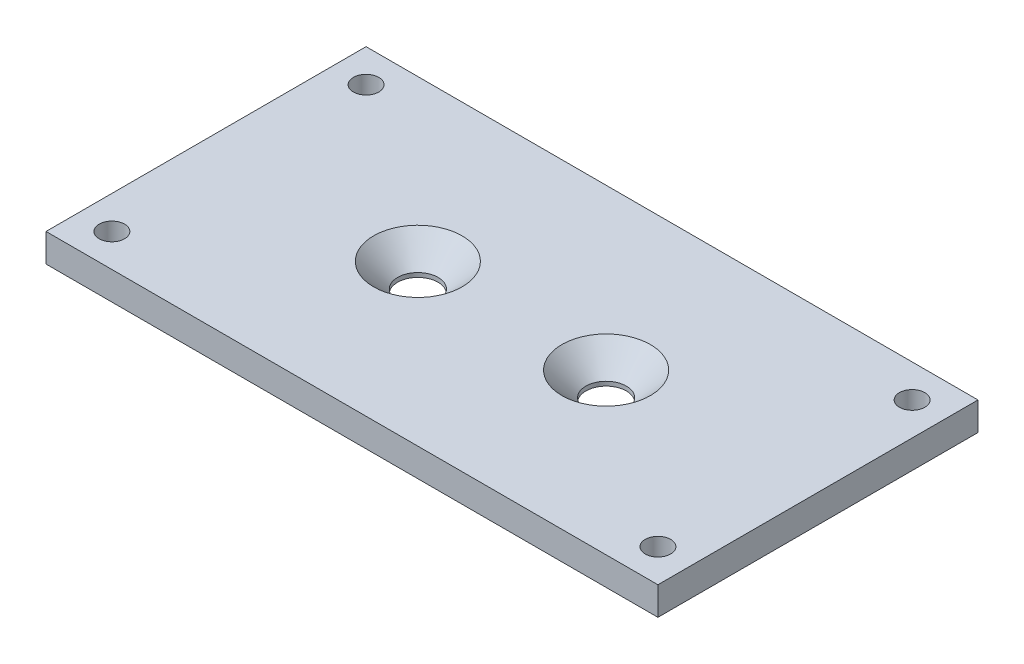
ISO-10303-21;
HEADER;
FILE_DESCRIPTION(('STEP AP214'),'2;1');
FILE_NAME('part.step','',(''),(''),'','','');
FILE_SCHEMA(('AUTOMOTIVE_DESIGN { 1 0 10303 214 1 1 1 1 }'));
ENDSEC;
DATA;
#1=APPLICATION_CONTEXT('core data for automotive mechanical design processes');
#2=APPLICATION_PROTOCOL_DEFINITION('international standard','automotive_design',2000,#1);
#3=PRODUCT_CONTEXT('',#1,'mechanical');
#4=PRODUCT('Part','Part','',(#3));
#5=PRODUCT_RELATED_PRODUCT_CATEGORY('part','',(#4));
#6=PRODUCT_DEFINITION_FORMATION('','',#4);
#7=PRODUCT_DEFINITION_CONTEXT('part definition',#1,'design');
#8=PRODUCT_DEFINITION('design','',#6,#7);
#9=PRODUCT_DEFINITION_SHAPE('','',#8);
#10=(LENGTH_UNIT() NAMED_UNIT(*) SI_UNIT(.MILLI.,.METRE.));
#11=(NAMED_UNIT(*) PLANE_ANGLE_UNIT() SI_UNIT($,.RADIAN.));
#12=(NAMED_UNIT(*) SI_UNIT($,.STERADIAN.) SOLID_ANGLE_UNIT());
#13=UNCERTAINTY_MEASURE_WITH_UNIT(LENGTH_MEASURE(1.E-05),#10,'distance_accuracy_value','');
#14=(GEOMETRIC_REPRESENTATION_CONTEXT(3) GLOBAL_UNCERTAINTY_ASSIGNED_CONTEXT((#13)) GLOBAL_UNIT_ASSIGNED_CONTEXT((#10,
#11,#12)) REPRESENTATION_CONTEXT('',''));
#15=CARTESIAN_POINT('',(0.,0.,0.));
#16=DIRECTION('',(0.,0.,1.));
#17=DIRECTION('',(1.,0.,0.));
#18=AXIS2_PLACEMENT_3D('',#15,#16,#17);
#19=CARTESIAN_POINT('',(0.,0.,0.));
#20=DIRECTION('',(0.,1.,0.));
#21=DIRECTION('',(0.,0.,1.));
#22=AXIS2_PLACEMENT_3D('',#19,#20,#21);
#23=PLANE('',#22);
#24=CARTESIAN_POINT('',(-9.99999999999999,0.,0.));
#25=DIRECTION('',(0.,1.,0.));
#26=DIRECTION('',(0.,0.,1.));
#27=AXIS2_PLACEMENT_3D('',#24,#25,#26);
#28=CIRCLE('',#27,2.15);
#29=CARTESIAN_POINT('',(-9.99999999999999,0.,2.15));
#30=VERTEX_POINT('',#29);
#31=EDGE_CURVE('E140',#30,#30,#28,.F.);
#32=ORIENTED_EDGE('',*,*,#31,.F.);
#33=EDGE_LOOP('',(#32));
#34=FACE_BOUND('',#33,.T.);
#35=CARTESIAN_POINT('',(10.,0.,0.));
#36=DIRECTION('',(0.,1.,0.));
#37=DIRECTION('',(0.,0.,1.));
#38=AXIS2_PLACEMENT_3D('',#35,#36,#37);
#39=CIRCLE('',#38,2.15);
#40=CARTESIAN_POINT('',(10.,0.,2.15));
#41=VERTEX_POINT('',#40);
#42=EDGE_CURVE('E131',#41,#41,#39,.F.);
#43=ORIENTED_EDGE('',*,*,#42,.F.);
#44=EDGE_LOOP('',(#43));
#45=FACE_BOUND('',#44,.T.);
#46=CARTESIAN_POINT('',(29.,0.,13.5));
#47=DIRECTION('',(0.,1.,0.));
#48=DIRECTION('',(0.,0.,1.));
#49=AXIS2_PLACEMENT_3D('',#46,#47,#48);
#50=CIRCLE('',#49,1.35);
#51=CARTESIAN_POINT('',(29.,0.,14.85));
#52=VERTEX_POINT('',#51);
#53=EDGE_CURVE('E99',#52,#52,#50,.F.);
#54=ORIENTED_EDGE('',*,*,#53,.F.);
#55=EDGE_LOOP('',(#54));
#56=FACE_BOUND('',#55,.T.);
#57=DIRECTION('',(0.,0.,-1.));
#58=VECTOR('',#57,1.);
#59=CARTESIAN_POINT('',(32.5,0.,-17.));
#60=LINE('',#59,#58);
#61=CARTESIAN_POINT('',(32.5,0.,17.));
#62=VERTEX_POINT('',#61);
#63=CARTESIAN_POINT('',(32.5,0.,-17.));
#64=VERTEX_POINT('',#63);
#65=EDGE_CURVE('E96',#62,#64,#60,.T.);
#66=ORIENTED_EDGE('',*,*,#65,.F.);
#67=DIRECTION('',(1.,0.,0.));
#68=VECTOR('',#67,1.);
#69=CARTESIAN_POINT('',(-32.5,0.,17.));
#70=LINE('',#69,#68);
#71=CARTESIAN_POINT('',(-32.5,0.,17.));
#72=VERTEX_POINT('',#71);
#73=EDGE_CURVE('E72',#72,#62,#70,.T.);
#74=ORIENTED_EDGE('',*,*,#73,.F.);
#75=DIRECTION('',(0.,0.,1.));
#76=VECTOR('',#75,1.);
#77=CARTESIAN_POINT('',(-32.5,0.,-17.));
#78=LINE('',#77,#76);
#79=CARTESIAN_POINT('',(-32.5,0.,-17.));
#80=VERTEX_POINT('',#79);
#81=EDGE_CURVE('E66',#80,#72,#78,.T.);
#82=ORIENTED_EDGE('',*,*,#81,.F.);
#83=DIRECTION('',(-1.,0.,0.));
#84=VECTOR('',#83,1.);
#85=CARTESIAN_POINT('',(-32.5,0.,-17.));
#86=LINE('',#85,#84);
#87=EDGE_CURVE('E88',#64,#80,#86,.T.);
#88=ORIENTED_EDGE('',*,*,#87,.F.);
#89=EDGE_LOOP('',(#66,#74,#82,#88));
#90=FACE_BOUND('',#89,.T.);
#91=CARTESIAN_POINT('',(29.,0.,-13.5));
#92=DIRECTION('',(0.,1.,0.));
#93=DIRECTION('',(0.,0.,1.));
#94=AXIS2_PLACEMENT_3D('',#91,#92,#93);
#95=CIRCLE('',#94,1.35);
#96=CARTESIAN_POINT('',(29.,0.,-12.15));
#97=VERTEX_POINT('',#96);
#98=EDGE_CURVE('E113',#97,#97,#95,.F.);
#99=ORIENTED_EDGE('',*,*,#98,.F.);
#100=EDGE_LOOP('',(#99));
#101=FACE_BOUND('',#100,.T.);
#102=CARTESIAN_POINT('',(-29.,0.,-13.5));
#103=DIRECTION('',(0.,1.,0.));
#104=DIRECTION('',(0.,0.,1.));
#105=AXIS2_PLACEMENT_3D('',#102,#103,#104);
#106=CIRCLE('',#105,1.35);
#107=CARTESIAN_POINT('',(-29.,0.,-12.15));
#108=VERTEX_POINT('',#107);
#109=EDGE_CURVE('E119',#108,#108,#106,.F.);
#110=ORIENTED_EDGE('',*,*,#109,.F.);
#111=EDGE_LOOP('',(#110));
#112=FACE_BOUND('',#111,.T.);
#113=CARTESIAN_POINT('',(-29.,0.,13.5));
#114=DIRECTION('',(0.,1.,0.));
#115=DIRECTION('',(0.,0.,1.));
#116=AXIS2_PLACEMENT_3D('',#113,#114,#115);
#117=CIRCLE('',#116,1.35);
#118=CARTESIAN_POINT('',(-29.,0.,14.85));
#119=VERTEX_POINT('',#118);
#120=EDGE_CURVE('E125',#119,#119,#117,.F.);
#121=ORIENTED_EDGE('',*,*,#120,.F.);
#122=EDGE_LOOP('',(#121));
#123=FACE_BOUND('',#122,.T.);
#124=ADVANCED_FACE('F32',(#34,#45,#56,#90,#101,#112,#123),#23,.F.);
#125=CARTESIAN_POINT('',(0.,3.,0.));
#126=DIRECTION('',(0.,1.,0.));
#127=DIRECTION('',(0.,0.,1.));
#128=AXIS2_PLACEMENT_3D('',#125,#126,#127);
#129=PLANE('',#128);
#130=CARTESIAN_POINT('',(-9.99999999999999,3.,0.));
#131=DIRECTION('',(0.,1.,0.));
#132=DIRECTION('',(0.,0.,1.));
#133=AXIS2_PLACEMENT_3D('',#130,#131,#132);
#134=CIRCLE('',#133,4.7);
#135=CARTESIAN_POINT('',(-9.99999999999999,3.,4.7));
#136=VERTEX_POINT('',#135);
#137=EDGE_CURVE('E146',#136,#136,#134,.T.);
#138=ORIENTED_EDGE('',*,*,#137,.F.);
#139=EDGE_LOOP('',(#138));
#140=FACE_BOUND('',#139,.T.);
#141=CARTESIAN_POINT('',(10.,3.,0.));
#142=DIRECTION('',(0.,1.,0.));
#143=DIRECTION('',(0.,0.,1.));
#144=AXIS2_PLACEMENT_3D('',#141,#142,#143);
#145=CIRCLE('',#144,4.7);
#146=CARTESIAN_POINT('',(10.,3.,4.7));
#147=VERTEX_POINT('',#146);
#148=EDGE_CURVE('E137',#147,#147,#145,.T.);
#149=ORIENTED_EDGE('',*,*,#148,.F.);
#150=EDGE_LOOP('',(#149));
#151=FACE_BOUND('',#150,.T.);
#152=CARTESIAN_POINT('',(-29.,3.,13.5));
#153=DIRECTION('',(0.,1.,0.));
#154=DIRECTION('',(0.,0.,1.));
#155=AXIS2_PLACEMENT_3D('',#152,#153,#154);
#156=CIRCLE('',#155,1.35);
#157=CARTESIAN_POINT('',(-29.,3.,14.85));
#158=VERTEX_POINT('',#157);
#159=EDGE_CURVE('E128',#158,#158,#156,.T.);
#160=ORIENTED_EDGE('',*,*,#159,.F.);
#161=EDGE_LOOP('',(#160));
#162=FACE_BOUND('',#161,.T.);
#163=CARTESIAN_POINT('',(-29.,3.,-13.5));
#164=DIRECTION('',(0.,1.,0.));
#165=DIRECTION('',(0.,0.,1.));
#166=AXIS2_PLACEMENT_3D('',#163,#164,#165);
#167=CIRCLE('',#166,1.35);
#168=CARTESIAN_POINT('',(-29.,3.,-12.15));
#169=VERTEX_POINT('',#168);
#170=EDGE_CURVE('E122',#169,#169,#167,.T.);
#171=ORIENTED_EDGE('',*,*,#170,.F.);
#172=EDGE_LOOP('',(#171));
#173=FACE_BOUND('',#172,.T.);
#174=CARTESIAN_POINT('',(29.,3.,-13.5));
#175=DIRECTION('',(0.,1.,0.));
#176=DIRECTION('',(0.,0.,1.));
#177=AXIS2_PLACEMENT_3D('',#174,#175,#176);
#178=CIRCLE('',#177,1.35);
#179=CARTESIAN_POINT('',(29.,3.,-12.15));
#180=VERTEX_POINT('',#179);
#181=EDGE_CURVE('E116',#180,#180,#178,.T.);
#182=ORIENTED_EDGE('',*,*,#181,.F.);
#183=EDGE_LOOP('',(#182));
#184=FACE_BOUND('',#183,.T.);
#185=CARTESIAN_POINT('',(29.,3.,13.5));
#186=DIRECTION('',(0.,1.,0.));
#187=DIRECTION('',(0.,0.,1.));
#188=AXIS2_PLACEMENT_3D('',#185,#186,#187);
#189=CIRCLE('',#188,1.35);
#190=CARTESIAN_POINT('',(29.,3.,14.85));
#191=VERTEX_POINT('',#190);
#192=EDGE_CURVE('E110',#191,#191,#189,.T.);
#193=ORIENTED_EDGE('',*,*,#192,.F.);
#194=EDGE_LOOP('',(#193));
#195=FACE_BOUND('',#194,.T.);
#196=DIRECTION('',(0.,0.,-1.));
#197=VECTOR('',#196,1.);
#198=CARTESIAN_POINT('',(32.5,3.,-17.));
#199=LINE('',#198,#197);
#200=CARTESIAN_POINT('',(32.5,3.,17.));
#201=VERTEX_POINT('',#200);
#202=CARTESIAN_POINT('',(32.5,3.,-17.));
#203=VERTEX_POINT('',#202);
#204=EDGE_CURVE('E84',#201,#203,#199,.T.);
#205=ORIENTED_EDGE('',*,*,#204,.T.);
#206=DIRECTION('',(-1.,0.,0.));
#207=VECTOR('',#206,1.);
#208=CARTESIAN_POINT('',(-32.5,3.,-17.));
#209=LINE('',#208,#207);
#210=CARTESIAN_POINT('',(-32.5,3.,-17.));
#211=VERTEX_POINT('',#210);
#212=EDGE_CURVE('E79',#203,#211,#209,.T.);
#213=ORIENTED_EDGE('',*,*,#212,.T.);
#214=DIRECTION('',(0.,0.,1.));
#215=VECTOR('',#214,1.);
#216=CARTESIAN_POINT('',(-32.5,3.,-17.));
#217=LINE('',#216,#215);
#218=CARTESIAN_POINT('',(-32.5,3.,17.));
#219=VERTEX_POINT('',#218);
#220=EDGE_CURVE('E82',#211,#219,#217,.T.);
#221=ORIENTED_EDGE('',*,*,#220,.T.);
#222=DIRECTION('',(1.,0.,0.));
#223=VECTOR('',#222,1.);
#224=CARTESIAN_POINT('',(-32.5,3.,17.));
#225=LINE('',#224,#223);
#226=EDGE_CURVE('E49',#219,#201,#225,.T.);
#227=ORIENTED_EDGE('',*,*,#226,.T.);
#228=EDGE_LOOP('',(#205,#213,#221,#227));
#229=FACE_BOUND('',#228,.T.);
#230=ADVANCED_FACE('F80',(#140,#151,#162,#173,#184,#195,#229),#129,.T.);
#231=CARTESIAN_POINT('',(32.5,3.,-17.));
#232=DIRECTION('',(-1.,0.,0.));
#233=DIRECTION('',(0.,0.,1.));
#234=AXIS2_PLACEMENT_3D('',#231,#232,#233);
#235=PLANE('',#234);
#236=ORIENTED_EDGE('',*,*,#65,.T.);
#237=DIRECTION('',(0.,-1.,0.));
#238=VECTOR('',#237,1.);
#239=CARTESIAN_POINT('',(32.5,3.,-17.));
#240=LINE('',#239,#238);
#241=EDGE_CURVE('E11',#203,#64,#240,.T.);
#242=ORIENTED_EDGE('',*,*,#241,.F.);
#243=ORIENTED_EDGE('',*,*,#204,.F.);
#244=DIRECTION('',(0.,-1.,0.));
#245=VECTOR('',#244,1.);
#246=CARTESIAN_POINT('',(32.5,3.,17.));
#247=LINE('',#246,#245);
#248=EDGE_CURVE('E92',#201,#62,#247,.T.);
#249=ORIENTED_EDGE('',*,*,#248,.T.);
#250=EDGE_LOOP('',(#236,#242,#243,#249));
#251=FACE_BOUND('',#250,.T.);
#252=ADVANCED_FACE('F34',(#251),#235,.F.);
#253=CARTESIAN_POINT('',(-32.5,3.,-17.));
#254=DIRECTION('',(0.,0.,1.));
#255=DIRECTION('',(1.,0.,0.));
#256=AXIS2_PLACEMENT_3D('',#253,#254,#255);
#257=PLANE('',#256);
#258=ORIENTED_EDGE('',*,*,#87,.T.);
#259=DIRECTION('',(0.,-1.,0.));
#260=VECTOR('',#259,1.);
#261=CARTESIAN_POINT('',(-32.5,3.,-17.));
#262=LINE('',#261,#260);
#263=EDGE_CURVE('E41',#211,#80,#262,.T.);
#264=ORIENTED_EDGE('',*,*,#263,.F.);
#265=ORIENTED_EDGE('',*,*,#212,.F.);
#266=ORIENTED_EDGE('',*,*,#241,.T.);
#267=EDGE_LOOP('',(#258,#264,#265,#266));
#268=FACE_BOUND('',#267,.T.);
#269=ADVANCED_FACE('F87',(#268),#257,.F.);
#270=CARTESIAN_POINT('',(-32.5,3.,-17.));
#271=DIRECTION('',(1.,0.,0.));
#272=DIRECTION('',(0.,0.,-1.));
#273=AXIS2_PLACEMENT_3D('',#270,#271,#272);
#274=PLANE('',#273);
#275=ORIENTED_EDGE('',*,*,#81,.T.);
#276=DIRECTION('',(0.,-1.,0.));
#277=VECTOR('',#276,1.);
#278=CARTESIAN_POINT('',(-32.5,3.,17.));
#279=LINE('',#278,#277);
#280=EDGE_CURVE('E89',#219,#72,#279,.T.);
#281=ORIENTED_EDGE('',*,*,#280,.F.);
#282=ORIENTED_EDGE('',*,*,#220,.F.);
#283=ORIENTED_EDGE('',*,*,#263,.T.);
#284=EDGE_LOOP('',(#275,#281,#282,#283));
#285=FACE_BOUND('',#284,.T.);
#286=ADVANCED_FACE('F90',(#285),#274,.F.);
#287=CARTESIAN_POINT('',(-32.5,3.,17.));
#288=DIRECTION('',(0.,0.,-1.));
#289=DIRECTION('',(-1.,0.,0.));
#290=AXIS2_PLACEMENT_3D('',#287,#288,#289);
#291=PLANE('',#290);
#292=ORIENTED_EDGE('',*,*,#73,.T.);
#293=ORIENTED_EDGE('',*,*,#248,.F.);
#294=ORIENTED_EDGE('',*,*,#226,.F.);
#295=ORIENTED_EDGE('',*,*,#280,.T.);
#296=EDGE_LOOP('',(#292,#293,#294,#295));
#297=FACE_BOUND('',#296,.T.);
#298=ADVANCED_FACE('F104',(#297),#291,.F.);
#299=CARTESIAN_POINT('',(29.,3.,13.5));
#300=DIRECTION('',(0.,1.,0.));
#301=DIRECTION('',(0.,0.,1.));
#302=AXIS2_PLACEMENT_3D('',#299,#300,#301);
#303=CYLINDRICAL_SURFACE('',#302,1.35);
#304=ORIENTED_EDGE('',*,*,#53,.T.);
#305=EDGE_LOOP('',(#304));
#306=FACE_BOUND('',#305,.T.);
#307=ORIENTED_EDGE('',*,*,#192,.T.);
#308=EDGE_LOOP('',(#307));
#309=FACE_BOUND('',#308,.T.);
#310=ADVANCED_FACE('F162',(#306,#309),#303,.F.);
#311=CARTESIAN_POINT('',(29.,3.,-13.5));
#312=DIRECTION('',(0.,1.,0.));
#313=DIRECTION('',(0.,0.,1.));
#314=AXIS2_PLACEMENT_3D('',#311,#312,#313);
#315=CYLINDRICAL_SURFACE('',#314,1.35);
#316=ORIENTED_EDGE('',*,*,#98,.T.);
#317=EDGE_LOOP('',(#316));
#318=FACE_BOUND('',#317,.T.);
#319=ORIENTED_EDGE('',*,*,#181,.T.);
#320=EDGE_LOOP('',(#319));
#321=FACE_BOUND('',#320,.T.);
#322=ADVANCED_FACE('F165',(#318,#321),#315,.F.);
#323=CARTESIAN_POINT('',(-29.,3.,-13.5));
#324=DIRECTION('',(0.,1.,0.));
#325=DIRECTION('',(0.,0.,1.));
#326=AXIS2_PLACEMENT_3D('',#323,#324,#325);
#327=CYLINDRICAL_SURFACE('',#326,1.35);
#328=ORIENTED_EDGE('',*,*,#109,.T.);
#329=EDGE_LOOP('',(#328));
#330=FACE_BOUND('',#329,.T.);
#331=ORIENTED_EDGE('',*,*,#170,.T.);
#332=EDGE_LOOP('',(#331));
#333=FACE_BOUND('',#332,.T.);
#334=ADVANCED_FACE('F205',(#330,#333),#327,.F.);
#335=CARTESIAN_POINT('',(-29.,3.,13.5));
#336=DIRECTION('',(0.,1.,0.));
#337=DIRECTION('',(0.,0.,1.));
#338=AXIS2_PLACEMENT_3D('',#335,#336,#337);
#339=CYLINDRICAL_SURFACE('',#338,1.35);
#340=ORIENTED_EDGE('',*,*,#120,.T.);
#341=EDGE_LOOP('',(#340));
#342=FACE_BOUND('',#341,.T.);
#343=ORIENTED_EDGE('',*,*,#159,.T.);
#344=EDGE_LOOP('',(#343));
#345=FACE_BOUND('',#344,.T.);
#346=ADVANCED_FACE('F212',(#342,#345),#339,.F.);
#347=CARTESIAN_POINT('',(10.,3.,0.));
#348=DIRECTION('',(0.,1.,0.));
#349=DIRECTION('',(0.,0.,1.));
#350=AXIS2_PLACEMENT_3D('',#347,#348,#349);
#351=CYLINDRICAL_SURFACE('',#350,2.15);
#352=ORIENTED_EDGE('',*,*,#42,.T.);
#353=EDGE_LOOP('',(#352));
#354=FACE_BOUND('',#353,.T.);
#355=CARTESIAN_POINT('',(10.,0.450000000000001,0.));
#356=DIRECTION('',(0.,1.,0.));
#357=DIRECTION('',(0.,0.,1.));
#358=AXIS2_PLACEMENT_3D('',#355,#356,#357);
#359=CIRCLE('',#358,2.15);
#360=CARTESIAN_POINT('',(10.,0.450000000000001,2.15));
#361=VERTEX_POINT('',#360);
#362=EDGE_CURVE('E134',#361,#361,#359,.T.);
#363=ORIENTED_EDGE('',*,*,#362,.T.);
#364=EDGE_LOOP('',(#363));
#365=FACE_BOUND('',#364,.T.);
#366=ADVANCED_FACE('F220',(#354,#365),#351,.F.);
#367=CARTESIAN_POINT('',(10.,3.,0.));
#368=DIRECTION('',(0.,1.,0.));
#369=DIRECTION('',(0.,0.,1.));
#370=AXIS2_PLACEMENT_3D('',#367,#368,#369);
#371=CONICAL_SURFACE('',#370,4.7,0.785398163397449);
#372=ORIENTED_EDGE('',*,*,#362,.F.);
#373=EDGE_LOOP('',(#372));
#374=FACE_BOUND('',#373,.T.);
#375=ORIENTED_EDGE('',*,*,#148,.T.);
#376=EDGE_LOOP('',(#375));
#377=FACE_BOUND('',#376,.T.);
#378=ADVANCED_FACE('F229',(#374,#377),#371,.F.);
#379=CARTESIAN_POINT('',(-9.99999999999999,3.,0.));
#380=DIRECTION('',(0.,1.,0.));
#381=DIRECTION('',(0.,0.,1.));
#382=AXIS2_PLACEMENT_3D('',#379,#380,#381);
#383=CYLINDRICAL_SURFACE('',#382,2.15);
#384=ORIENTED_EDGE('',*,*,#31,.T.);
#385=EDGE_LOOP('',(#384));
#386=FACE_BOUND('',#385,.T.);
#387=CARTESIAN_POINT('',(-9.99999999999999,0.450000000000001,0.));
#388=DIRECTION('',(0.,1.,0.));
#389=DIRECTION('',(0.,0.,1.));
#390=AXIS2_PLACEMENT_3D('',#387,#388,#389);
#391=CIRCLE('',#390,2.15);
#392=CARTESIAN_POINT('',(-9.99999999999999,0.450000000000001,2.15));
#393=VERTEX_POINT('',#392);
#394=EDGE_CURVE('E143',#393,#393,#391,.T.);
#395=ORIENTED_EDGE('',*,*,#394,.T.);
#396=EDGE_LOOP('',(#395));
#397=FACE_BOUND('',#396,.T.);
#398=ADVANCED_FACE('F152',(#386,#397),#383,.F.);
#399=CARTESIAN_POINT('',(-9.99999999999999,3.,0.));
#400=DIRECTION('',(0.,1.,0.));
#401=DIRECTION('',(0.,0.,1.));
#402=AXIS2_PLACEMENT_3D('',#399,#400,#401);
#403=CONICAL_SURFACE('',#402,4.7,0.785398163397449);
#404=ORIENTED_EDGE('',*,*,#394,.F.);
#405=EDGE_LOOP('',(#404));
#406=FACE_BOUND('',#405,.T.);
#407=ORIENTED_EDGE('',*,*,#137,.T.);
#408=EDGE_LOOP('',(#407));
#409=FACE_BOUND('',#408,.T.);
#410=ADVANCED_FACE('F244',(#406,#409),#403,.F.);
#411=CLOSED_SHELL('',(#124,#230,#252,#269,#286,#298,#310,#322,#334,#346,#366,#378,#398,#410));
#412=MANIFOLD_SOLID_BREP('B2',#411);
#413=ADVANCED_BREP_SHAPE_REPRESENTATION('',(#18,#412),#14);
#414=SHAPE_DEFINITION_REPRESENTATION(#9,#413);
ENDSEC;
END-ISO-10303-21;
